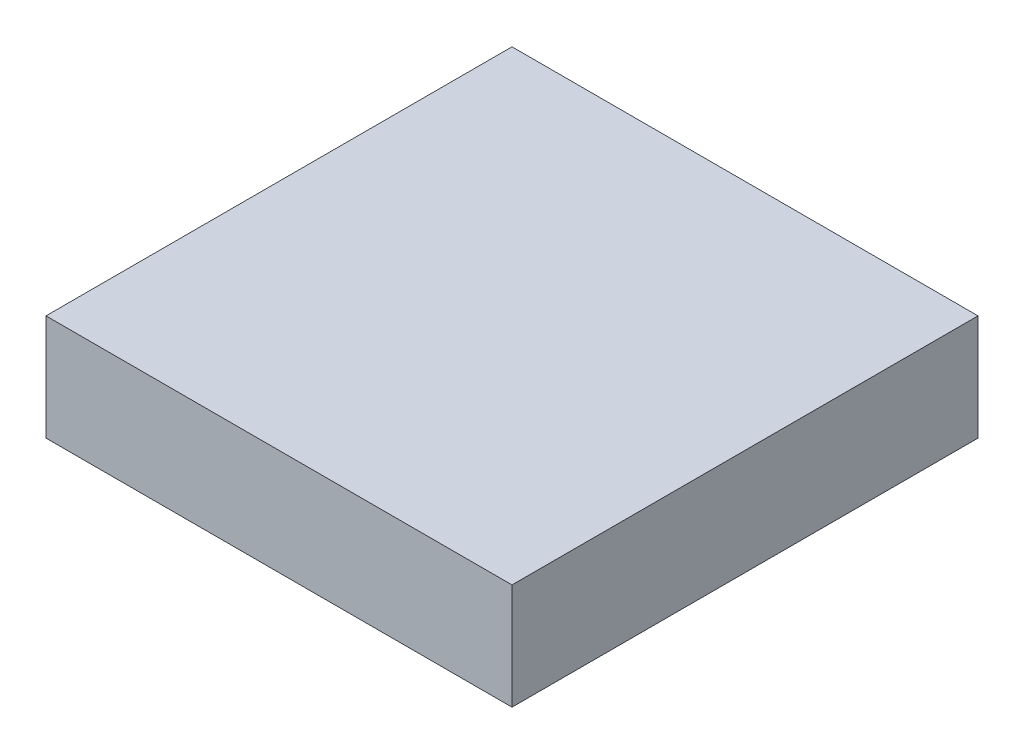
ISO-10303-21;
HEADER;
FILE_DESCRIPTION(('STEP AP214'),'2;1');
FILE_NAME('part.step','',(''),(''),'','','');
FILE_SCHEMA(('AUTOMOTIVE_DESIGN { 1 0 10303 214 1 1 1 1 }'));
ENDSEC;
DATA;
#1=APPLICATION_CONTEXT('core data for automotive mechanical design processes');
#2=APPLICATION_PROTOCOL_DEFINITION('international standard','automotive_design',2000,#1);
#3=PRODUCT_CONTEXT('',#1,'mechanical');
#4=PRODUCT('Part','Part','',(#3));
#5=PRODUCT_RELATED_PRODUCT_CATEGORY('part','',(#4));
#6=PRODUCT_DEFINITION_FORMATION('','',#4);
#7=PRODUCT_DEFINITION_CONTEXT('part definition',#1,'design');
#8=PRODUCT_DEFINITION('design','',#6,#7);
#9=PRODUCT_DEFINITION_SHAPE('','',#8);
#10=(LENGTH_UNIT() NAMED_UNIT(*) SI_UNIT(.MILLI.,.METRE.));
#11=(NAMED_UNIT(*) PLANE_ANGLE_UNIT() SI_UNIT($,.RADIAN.));
#12=(NAMED_UNIT(*) SI_UNIT($,.STERADIAN.) SOLID_ANGLE_UNIT());
#13=UNCERTAINTY_MEASURE_WITH_UNIT(LENGTH_MEASURE(1.E-05),#10,'distance_accuracy_value','');
#14=(GEOMETRIC_REPRESENTATION_CONTEXT(3) GLOBAL_UNCERTAINTY_ASSIGNED_CONTEXT((#13)) GLOBAL_UNIT_ASSIGNED_CONTEXT((#10,
#11,#12)) REPRESENTATION_CONTEXT('',''));
#15=CARTESIAN_POINT('',(0.,0.,0.));
#16=DIRECTION('',(0.,0.,1.));
#17=DIRECTION('',(1.,0.,0.));
#18=AXIS2_PLACEMENT_3D('',#15,#16,#17);
#19=CARTESIAN_POINT('',(27.94,6.35,27.94));
#20=DIRECTION('',(-1.,0.,0.));
#21=DIRECTION('',(0.,0.,1.));
#22=AXIS2_PLACEMENT_3D('',#19,#20,#21);
#23=PLANE('',#22);
#24=DIRECTION('',(0.,0.,-1.));
#25=VECTOR('',#24,1.);
#26=CARTESIAN_POINT('',(27.94,-6.35,27.94));
#27=LINE('',#26,#25);
#28=CARTESIAN_POINT('',(27.94,-6.35,27.94));
#29=VERTEX_POINT('',#28);
#30=CARTESIAN_POINT('',(27.94,-6.35,-27.94));
#31=VERTEX_POINT('',#30);
#32=EDGE_CURVE('E111',#29,#31,#27,.T.);
#33=ORIENTED_EDGE('',*,*,#32,.T.);
#34=DIRECTION('',(0.,-1.,0.));
#35=VECTOR('',#34,1.);
#36=CARTESIAN_POINT('',(27.94,6.35,-27.94));
#37=LINE('',#36,#35);
#38=CARTESIAN_POINT('',(27.94,6.35,-27.94));
#39=VERTEX_POINT('',#38);
#40=EDGE_CURVE('E11',#39,#31,#37,.T.);
#41=ORIENTED_EDGE('',*,*,#40,.F.);
#42=DIRECTION('',(0.,0.,-1.));
#43=VECTOR('',#42,1.);
#44=CARTESIAN_POINT('',(27.94,6.35,27.94));
#45=LINE('',#44,#43);
#46=CARTESIAN_POINT('',(27.94,6.35,27.94));
#47=VERTEX_POINT('',#46);
#48=EDGE_CURVE('E95',#47,#39,#45,.T.);
#49=ORIENTED_EDGE('',*,*,#48,.F.);
#50=DIRECTION('',(0.,-1.,0.));
#51=VECTOR('',#50,1.);
#52=CARTESIAN_POINT('',(27.94,6.35,27.94));
#53=LINE('',#52,#51);
#54=EDGE_CURVE('E107',#47,#29,#53,.T.);
#55=ORIENTED_EDGE('',*,*,#54,.T.);
#56=EDGE_LOOP('',(#33,#41,#49,#55));
#57=FACE_BOUND('',#56,.T.);
#58=ADVANCED_FACE('F43',(#57),#23,.F.);
#59=CARTESIAN_POINT('',(-27.94,6.35,-27.94));
#60=DIRECTION('',(0.,0.,1.));
#61=DIRECTION('',(1.,0.,0.));
#62=AXIS2_PLACEMENT_3D('',#59,#60,#61);
#63=PLANE('',#62);
#64=DIRECTION('',(-1.,0.,0.));
#65=VECTOR('',#64,1.);
#66=CARTESIAN_POINT('',(-27.94,-6.35,-27.94));
#67=LINE('',#66,#65);
#68=CARTESIAN_POINT('',(-27.94,-6.35,-27.94));
#69=VERTEX_POINT('',#68);
#70=EDGE_CURVE('E100',#31,#69,#67,.T.);
#71=ORIENTED_EDGE('',*,*,#70,.T.);
#72=DIRECTION('',(0.,-1.,0.));
#73=VECTOR('',#72,1.);
#74=CARTESIAN_POINT('',(-27.94,6.35,-27.94));
#75=LINE('',#74,#73);
#76=CARTESIAN_POINT('',(-27.94,6.35,-27.94));
#77=VERTEX_POINT('',#76);
#78=EDGE_CURVE('E52',#77,#69,#75,.T.);
#79=ORIENTED_EDGE('',*,*,#78,.F.);
#80=DIRECTION('',(-1.,0.,0.));
#81=VECTOR('',#80,1.);
#82=CARTESIAN_POINT('',(-27.94,6.35,-27.94));
#83=LINE('',#82,#81);
#84=EDGE_CURVE('E90',#39,#77,#83,.T.);
#85=ORIENTED_EDGE('',*,*,#84,.F.);
#86=ORIENTED_EDGE('',*,*,#40,.T.);
#87=EDGE_LOOP('',(#71,#79,#85,#86));
#88=FACE_BOUND('',#87,.T.);
#89=ADVANCED_FACE('F99',(#88),#63,.F.);
#90=CARTESIAN_POINT('',(-27.94,6.35,27.94));
#91=DIRECTION('',(1.,0.,0.));
#92=DIRECTION('',(0.,0.,-1.));
#93=AXIS2_PLACEMENT_3D('',#90,#91,#92);
#94=PLANE('',#93);
#95=DIRECTION('',(0.,0.,1.));
#96=VECTOR('',#95,1.);
#97=CARTESIAN_POINT('',(-27.94,-6.35,27.94));
#98=LINE('',#97,#96);
#99=CARTESIAN_POINT('',(-27.94,-6.35,27.94));
#100=VERTEX_POINT('',#99);
#101=EDGE_CURVE('E77',#69,#100,#98,.T.);
#102=ORIENTED_EDGE('',*,*,#101,.T.);
#103=DIRECTION('',(0.,-1.,0.));
#104=VECTOR('',#103,1.);
#105=CARTESIAN_POINT('',(-27.94,6.35,27.94));
#106=LINE('',#105,#104);
#107=CARTESIAN_POINT('',(-27.94,6.35,27.94));
#108=VERTEX_POINT('',#107);
#109=EDGE_CURVE('E102',#108,#100,#106,.T.);
#110=ORIENTED_EDGE('',*,*,#109,.F.);
#111=DIRECTION('',(0.,0.,1.));
#112=VECTOR('',#111,1.);
#113=CARTESIAN_POINT('',(-27.94,6.35,27.94));
#114=LINE('',#113,#112);
#115=EDGE_CURVE('E93',#77,#108,#114,.T.);
#116=ORIENTED_EDGE('',*,*,#115,.F.);
#117=ORIENTED_EDGE('',*,*,#78,.T.);
#118=EDGE_LOOP('',(#102,#110,#116,#117));
#119=FACE_BOUND('',#118,.T.);
#120=ADVANCED_FACE('F103',(#119),#94,.F.);
#121=CARTESIAN_POINT('',(-27.94,6.35,27.94));
#122=DIRECTION('',(0.,0.,-1.));
#123=DIRECTION('',(-1.,0.,0.));
#124=AXIS2_PLACEMENT_3D('',#121,#122,#123);
#125=PLANE('',#124);
#126=DIRECTION('',(1.,0.,0.));
#127=VECTOR('',#126,1.);
#128=CARTESIAN_POINT('',(-27.94,-6.35,27.94));
#129=LINE('',#128,#127);
#130=EDGE_CURVE('E83',#100,#29,#129,.T.);
#131=ORIENTED_EDGE('',*,*,#130,.T.);
#132=ORIENTED_EDGE('',*,*,#54,.F.);
#133=DIRECTION('',(1.,0.,0.));
#134=VECTOR('',#133,1.);
#135=CARTESIAN_POINT('',(-27.94,6.35,27.94));
#136=LINE('',#135,#134);
#137=EDGE_CURVE('E60',#108,#47,#136,.T.);
#138=ORIENTED_EDGE('',*,*,#137,.F.);
#139=ORIENTED_EDGE('',*,*,#109,.T.);
#140=EDGE_LOOP('',(#131,#132,#138,#139));
#141=FACE_BOUND('',#140,.T.);
#142=ADVANCED_FACE('F124',(#141),#125,.F.);
#143=CARTESIAN_POINT('',(0.,6.35,0.));
#144=DIRECTION('',(0.,-1.,0.));
#145=DIRECTION('',(0.,0.,-1.));
#146=AXIS2_PLACEMENT_3D('',#143,#144,#145);
#147=PLANE('',#146);
#148=ORIENTED_EDGE('',*,*,#48,.T.);
#149=ORIENTED_EDGE('',*,*,#84,.T.);
#150=ORIENTED_EDGE('',*,*,#115,.T.);
#151=ORIENTED_EDGE('',*,*,#137,.T.);
#152=EDGE_LOOP('',(#148,#149,#150,#151));
#153=FACE_BOUND('',#152,.T.);
#154=ADVANCED_FACE('F91',(#153),#147,.F.);
#155=CARTESIAN_POINT('',(0.,-6.35,0.));
#156=DIRECTION('',(0.,-1.,0.));
#157=DIRECTION('',(0.,0.,-1.));
#158=AXIS2_PLACEMENT_3D('',#155,#156,#157);
#159=PLANE('',#158);
#160=ORIENTED_EDGE('',*,*,#32,.F.);
#161=ORIENTED_EDGE('',*,*,#130,.F.);
#162=ORIENTED_EDGE('',*,*,#101,.F.);
#163=ORIENTED_EDGE('',*,*,#70,.F.);
#164=EDGE_LOOP('',(#160,#161,#162,#163));
#165=FACE_BOUND('',#164,.T.);
#166=ADVANCED_FACE('F127',(#165),#159,.T.);
#167=CLOSED_SHELL('',(#58,#89,#120,#142,#154,#166));
#168=MANIFOLD_SOLID_BREP('B2',#167);
#169=ADVANCED_BREP_SHAPE_REPRESENTATION('',(#18,#168),#14);
#170=SHAPE_DEFINITION_REPRESENTATION(#9,#169);
ENDSEC;
END-ISO-10303-21;
